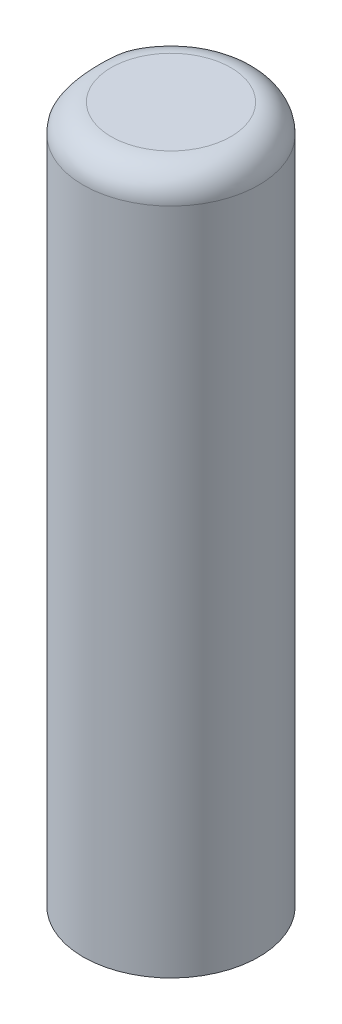
ISO-10303-21;
HEADER;
FILE_DESCRIPTION(('STEP AP214'),'2;1');
FILE_NAME('part.step','',(''),(''),'','','');
FILE_SCHEMA(('AUTOMOTIVE_DESIGN { 1 0 10303 214 1 1 1 1 }'));
ENDSEC;
DATA;
#1=APPLICATION_CONTEXT('core data for automotive mechanical design processes');
#2=APPLICATION_PROTOCOL_DEFINITION('international standard','automotive_design',2000,#1);
#3=PRODUCT_CONTEXT('',#1,'mechanical');
#4=PRODUCT('Part','Part','',(#3));
#5=PRODUCT_RELATED_PRODUCT_CATEGORY('part','',(#4));
#6=PRODUCT_DEFINITION_FORMATION('','',#4);
#7=PRODUCT_DEFINITION_CONTEXT('part definition',#1,'design');
#8=PRODUCT_DEFINITION('design','',#6,#7);
#9=PRODUCT_DEFINITION_SHAPE('','',#8);
#10=(LENGTH_UNIT() NAMED_UNIT(*) SI_UNIT(.MILLI.,.METRE.));
#11=(NAMED_UNIT(*) PLANE_ANGLE_UNIT() SI_UNIT($,.RADIAN.));
#12=(NAMED_UNIT(*) SI_UNIT($,.STERADIAN.) SOLID_ANGLE_UNIT());
#13=UNCERTAINTY_MEASURE_WITH_UNIT(LENGTH_MEASURE(1.E-05),#10,'distance_accuracy_value','');
#14=(GEOMETRIC_REPRESENTATION_CONTEXT(3) GLOBAL_UNCERTAINTY_ASSIGNED_CONTEXT((#13)) GLOBAL_UNIT_ASSIGNED_CONTEXT((#10,
#11,#12)) REPRESENTATION_CONTEXT('',''));
#15=CARTESIAN_POINT('',(0.,0.,0.));
#16=DIRECTION('',(0.,0.,1.));
#17=DIRECTION('',(1.,0.,0.));
#18=AXIS2_PLACEMENT_3D('',#15,#16,#17);
#19=CARTESIAN_POINT('',(-1.26,6.2,-1.57));
#20=DIRECTION('',(0.707106781186544,-0.707106781186551,0.));
#21=DIRECTION('',(0.,0.,-1.));
#22=AXIS2_PLACEMENT_3D('',#19,#20,#21);
#23=PLANE('',#22);
#24=CARTESIAN_POINT('',(1.47104550762833E-13,7.46000000000014,0.));
#25=DIRECTION('',(0.707106781186544,-0.707106781186551,0.));
#26=DIRECTION('',(0.707106781186551,0.707106781186544,0.));
#27=AXIS2_PLACEMENT_3D('',#24,#25,#26);
#28=ELLIPSE('',#27,2.22031529292596,1.57000000000007);
#29=CARTESIAN_POINT('',(-1.26,6.2,0.936642941573789));
#30=VERTEX_POINT('',#29);
#31=CARTESIAN_POINT('',(-1.26,6.2,-0.936642941573789));
#32=VERTEX_POINT('',#31);
#33=EDGE_CURVE('E62',#30,#32,#28,.T.);
#34=ORIENTED_EDGE('',*,*,#33,.F.);
#35=DIRECTION('',(0.,0.,-1.));
#36=VECTOR('',#35,1.);
#37=CARTESIAN_POINT('',(-1.26,6.2,0.));
#38=LINE('',#37,#36);
#39=EDGE_CURVE('E11',#30,#32,#38,.T.);
#40=ORIENTED_EDGE('',*,*,#39,.T.);
#41=EDGE_LOOP('',(#34,#40));
#42=FACE_BOUND('',#41,.T.);
#43=ADVANCED_FACE('F17',(#42),#23,.F.);
#44=CARTESIAN_POINT('',(-1.26,6.2,0.));
#45=DIRECTION('',(1.,0.,0.));
#46=DIRECTION('',(0.,1.,0.));
#47=AXIS2_PLACEMENT_3D('',#44,#45,#46);
#48=PLANE('',#47);
#49=DIRECTION('',(0.,1.,0.));
#50=VECTOR('',#49,1.);
#51=CARTESIAN_POINT('',(-1.26,6.2,0.936642941573789));
#52=LINE('',#51,#50);
#53=CARTESIAN_POINT('',(-1.26,11.95,0.936642941573789));
#54=VERTEX_POINT('',#53);
#55=EDGE_CURVE('E68',#30,#54,#52,.T.);
#56=ORIENTED_EDGE('',*,*,#55,.T.);
#57=CARTESIAN_POINT('',(-1.26,11.95,0.936642941573789));
#58=CARTESIAN_POINT('',(-1.26,11.9695666746061,0.936691886798482));
#59=CARTESIAN_POINT('',(-1.26,11.9890818342319,0.934721664127424));
#60=CARTESIAN_POINT('',(-1.26,12.0272143566579,0.927168286048991));
#61=CARTESIAN_POINT('',(-1.26,12.045838514046,0.921619817033221));
#62=CARTESIAN_POINT('',(-1.26,12.0817419238443,0.907340773230696));
#63=CARTESIAN_POINT('',(-1.26,12.0990247203964,0.898618956291073));
#64=CARTESIAN_POINT('',(-1.26,12.132016222329,0.878538902454836));
#65=CARTESIAN_POINT('',(-1.26,12.1477208456271,0.86717406839684));
#66=CARTESIAN_POINT('',(-1.26,12.1831043355342,0.837573366020989));
#67=CARTESIAN_POINT('',(-1.26,12.2019783648171,0.818378352766933));
#68=CARTESIAN_POINT('',(-1.26,12.2364163510718,0.777258279919741));
#69=CARTESIAN_POINT('',(-1.26,12.251976270547,0.755329941334963));
#70=CARTESIAN_POINT('',(-1.26,12.2883024935142,0.696376395674381));
#71=CARTESIAN_POINT('',(-1.26,12.306835104059,0.657987046678423));
#72=CARTESIAN_POINT('',(-1.26,12.3380644873898,0.578880154139512));
#73=CARTESIAN_POINT('',(-1.26,12.3507380406437,0.538154054234938));
#74=CARTESIAN_POINT('',(-1.26,12.375574100016,0.440310936650657));
#75=CARTESIAN_POINT('',(-1.26,12.3858016561053,0.382719796128729));
#76=CARTESIAN_POINT('',(-1.26,12.4008927619931,0.266784946656584));
#77=CARTESIAN_POINT('',(-1.26,12.4057419486048,0.208439641509187));
#78=CARTESIAN_POINT('',(-1.26,12.4117366223832,0.0914832990417817));
#79=CARTESIAN_POINT('',(-1.26,12.4128762944732,0.0328719885974682));
#80=CARTESIAN_POINT('',(-1.26,12.4118949092184,-0.0842458541996161));
#81=CARTESIAN_POINT('',(-1.26,12.4097785382085,-0.142752416028883));
#82=CARTESIAN_POINT('',(-1.26,12.4025923333939,-0.243478908489509));
#83=CARTESIAN_POINT('',(-1.26,12.3984917433654,-0.285764690935347));
#84=CARTESIAN_POINT('',(-1.26,12.3873809322377,-0.370012214524856));
#85=CARTESIAN_POINT('',(-1.26,12.3803680230029,-0.411973619716922));
#86=CARTESIAN_POINT('',(-1.26,12.3601895420474,-0.505316939599112));
#87=CARTESIAN_POINT('',(-1.26,12.3459347358444,-0.556476661098195));
#88=CARTESIAN_POINT('',(-1.26,12.308569031494,-0.655492901550963));
#89=CARTESIAN_POINT('',(-1.26,12.2855109722622,-0.703367155974013));
#90=CARTESIAN_POINT('',(-1.26,12.2440683416689,-0.76640226535216));
#91=CARTESIAN_POINT('',(-1.26,12.2304693081024,-0.784697945090626));
#92=CARTESIAN_POINT('',(-1.26,12.200865490017,-0.819277238320001));
#93=CARTESIAN_POINT('',(-1.26,12.1848599385799,-0.835560207367552));
#94=CARTESIAN_POINT('',(-1.26,12.1501944067186,-0.865515287470709));
#95=CARTESIAN_POINT('',(-1.26,12.1315051084524,-0.879154027859102));
#96=CARTESIAN_POINT('',(-1.26,12.0918848274954,-0.902596961378516));
#97=CARTESIAN_POINT('',(-1.26,12.0709613044524,-0.912413435898626));
#98=CARTESIAN_POINT('',(-1.26,12.0333451402395,-0.92532916266952));
#99=CARTESIAN_POINT('',(-1.26,12.0170268966212,-0.92952470190988));
#100=CARTESIAN_POINT('',(-1.26,11.9838185001559,-0.935203545571375));
#101=CARTESIAN_POINT('',(-1.26,11.9669252944073,-0.93666885079969));
#102=CARTESIAN_POINT('',(-1.26,11.95,-0.936642941573789));
#103=B_SPLINE_CURVE_WITH_KNOTS('',3,(#57,#58,#59,#60,#61,#62,#63,#64,#65,#66,#67,#68,#69,#70,
#71,#72,#73,#74,#75,#76,#77,#78,#79,#80,#81,#82,#83,#84,#85,#86,#87,#88,#89,#90,#91,#92,#93,#94,
#95,#96,#97,#98,#99,#100,#101,#102),.UNSPECIFIED.,.F.,.F.,(4,2,2,2,2,2,2,2,2,2,2,2,2,2,2,2,2,2,
2,2,2,2,4),(0.,0.0585194205913445,0.116479929503597,0.174281676749109,0.232229279939177,
0.312537326736729,0.39294265816337,0.520102062130575,0.64776116971912,0.82279404937897,
0.998293245385153,1.17406742374389,1.34958885163993,1.47697020636743,1.60446939917986,
1.76333682498652,1.92126531756719,1.98948312046119,2.05772270952385,2.12677425014578,
2.19560205216329,2.24593029375759,2.2965891684392),.UNSPECIFIED.);
#104=CARTESIAN_POINT('',(-1.26,11.95,-0.936642941573789));
#105=VERTEX_POINT('',#104);
#106=EDGE_CURVE('E20',#54,#105,#103,.T.);
#107=ORIENTED_EDGE('',*,*,#106,.T.);
#108=DIRECTION('',(0.,1.,0.));
#109=VECTOR('',#108,1.);
#110=CARTESIAN_POINT('',(-1.26,6.2,-0.936642941573789));
#111=LINE('',#110,#109);
#112=EDGE_CURVE('E32',#32,#105,#111,.T.);
#113=ORIENTED_EDGE('',*,*,#112,.F.);
#114=ORIENTED_EDGE('',*,*,#39,.F.);
#115=EDGE_LOOP('',(#56,#107,#113,#114));
#116=FACE_BOUND('',#115,.T.);
#117=ADVANCED_FACE('F67',(#116),#48,.F.);
#118=CARTESIAN_POINT('',(0.,0.,0.));
#119=DIRECTION('',(0.,1.,0.));
#120=DIRECTION('',(1.,0.,0.));
#121=AXIS2_PLACEMENT_3D('',#118,#119,#120);
#122=PLANE('',#121);
#123=CARTESIAN_POINT('',(0.,0.,0.));
#124=DIRECTION('',(0.,1.,0.));
#125=DIRECTION('',(0.,0.,1.));
#126=AXIS2_PLACEMENT_3D('',#123,#124,#125);
#127=CIRCLE('',#126,1.57);
#128=CARTESIAN_POINT('',(0.,0.,1.57));
#129=VERTEX_POINT('',#128);
#130=EDGE_CURVE('E71',#129,#129,#127,.T.);
#131=ORIENTED_EDGE('',*,*,#130,.F.);
#132=EDGE_LOOP('',(#131));
#133=FACE_BOUND('',#132,.T.);
#134=ADVANCED_FACE('F93',(#133),#122,.F.);
#135=CARTESIAN_POINT('',(0.,12.45,0.));
#136=DIRECTION('',(0.,1.,0.));
#137=DIRECTION('',(1.,0.,0.));
#138=AXIS2_PLACEMENT_3D('',#135,#136,#137);
#139=PLANE('',#138);
#140=CARTESIAN_POINT('',(0.,12.45,0.));
#141=DIRECTION('',(0.,1.,0.));
#142=DIRECTION('',(0.,0.,1.));
#143=AXIS2_PLACEMENT_3D('',#140,#141,#142);
#144=CIRCLE('',#143,1.07);
#145=CARTESIAN_POINT('',(0.,12.45,1.07));
#146=VERTEX_POINT('',#145);
#147=EDGE_CURVE('E75',#146,#146,#144,.T.);
#148=ORIENTED_EDGE('',*,*,#147,.T.);
#149=EDGE_LOOP('',(#148));
#150=FACE_BOUND('',#149,.T.);
#151=ADVANCED_FACE('F95',(#150),#139,.T.);
#152=CARTESIAN_POINT('',(0.,12.45,0.));
#153=DIRECTION('',(0.,-1.,0.));
#154=DIRECTION('',(0.,0.,-1.));
#155=AXIS2_PLACEMENT_3D('',#152,#153,#154);
#156=CYLINDRICAL_SURFACE('',#155,1.57);
#157=CARTESIAN_POINT('',(0.,11.95,0.));
#158=DIRECTION('',(0.,-1.,0.));
#159=DIRECTION('',(0.,0.,1.));
#160=AXIS2_PLACEMENT_3D('',#157,#158,#159);
#161=CIRCLE('',#160,1.57);
#162=EDGE_CURVE('E55',#105,#54,#161,.T.);
#163=ORIENTED_EDGE('',*,*,#162,.T.);
#164=ORIENTED_EDGE('',*,*,#55,.F.);
#165=ORIENTED_EDGE('',*,*,#33,.T.);
#166=ORIENTED_EDGE('',*,*,#112,.T.);
#167=EDGE_LOOP('',(#163,#164,#165,#166));
#168=FACE_BOUND('',#167,.T.);
#169=ORIENTED_EDGE('',*,*,#130,.T.);
#170=EDGE_LOOP('',(#169));
#171=FACE_BOUND('',#170,.T.);
#172=ADVANCED_FACE('F60',(#168,#171),#156,.T.);
#173=CARTESIAN_POINT('',(0.,11.95,0.));
#174=DIRECTION('',(0.,1.,0.));
#175=DIRECTION('',(0.,0.,1.));
#176=AXIS2_PLACEMENT_3D('',#173,#174,#175);
#177=TOROIDAL_SURFACE('',#176,1.07,0.5);
#178=ORIENTED_EDGE('',*,*,#106,.F.);
#179=ORIENTED_EDGE('',*,*,#162,.F.);
#180=EDGE_LOOP('',(#178,#179));
#181=FACE_BOUND('',#180,.T.);
#182=ORIENTED_EDGE('',*,*,#147,.F.);
#183=EDGE_LOOP('',(#182));
#184=FACE_BOUND('',#183,.T.);
#185=ADVANCED_FACE('F72',(#181,#184),#177,.T.);
#186=CLOSED_SHELL('',(#43,#117,#134,#151,#172,#185));
#187=MANIFOLD_SOLID_BREP('B1',#186);
#188=ADVANCED_BREP_SHAPE_REPRESENTATION('',(#18,#187),#14);
#189=SHAPE_DEFINITION_REPRESENTATION(#9,#188);
ENDSEC;
END-ISO-10303-21;
